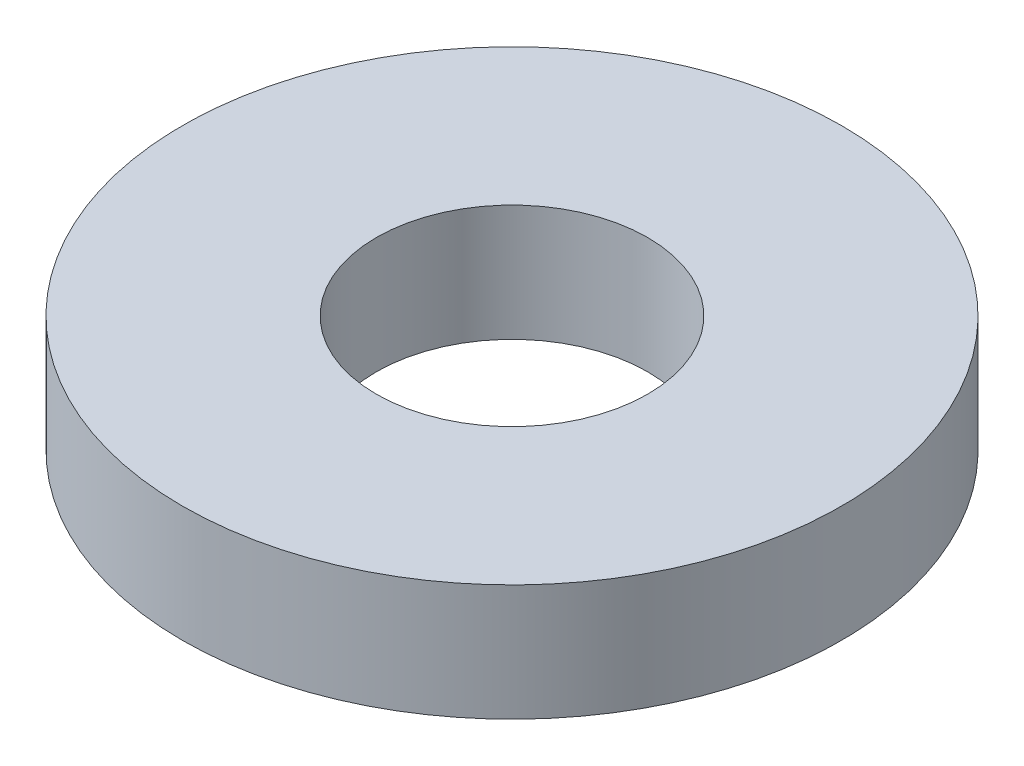
ISO-10303-21;
HEADER;
FILE_DESCRIPTION(('STEP AP214'),'2;1');
FILE_NAME('part.step','',(''),(''),'','','');
FILE_SCHEMA(('AUTOMOTIVE_DESIGN { 1 0 10303 214 1 1 1 1 }'));
ENDSEC;
DATA;
#1=APPLICATION_CONTEXT('core data for automotive mechanical design processes');
#2=APPLICATION_PROTOCOL_DEFINITION('international standard','automotive_design',2000,#1);
#3=PRODUCT_CONTEXT('',#1,'mechanical');
#4=PRODUCT('Part','Part','',(#3));
#5=PRODUCT_RELATED_PRODUCT_CATEGORY('part','',(#4));
#6=PRODUCT_DEFINITION_FORMATION('','',#4);
#7=PRODUCT_DEFINITION_CONTEXT('part definition',#1,'design');
#8=PRODUCT_DEFINITION('design','',#6,#7);
#9=PRODUCT_DEFINITION_SHAPE('','',#8);
#10=(LENGTH_UNIT() NAMED_UNIT(*) SI_UNIT(.MILLI.,.METRE.));
#11=(NAMED_UNIT(*) PLANE_ANGLE_UNIT() SI_UNIT($,.RADIAN.));
#12=(NAMED_UNIT(*) SI_UNIT($,.STERADIAN.) SOLID_ANGLE_UNIT());
#13=UNCERTAINTY_MEASURE_WITH_UNIT(LENGTH_MEASURE(1.E-05),#10,'distance_accuracy_value','');
#14=(GEOMETRIC_REPRESENTATION_CONTEXT(3) GLOBAL_UNCERTAINTY_ASSIGNED_CONTEXT((#13)) GLOBAL_UNIT_ASSIGNED_CONTEXT((#10,
#11,#12)) REPRESENTATION_CONTEXT('',''));
#15=CARTESIAN_POINT('',(0.,0.,0.));
#16=DIRECTION('',(0.,0.,1.));
#17=DIRECTION('',(1.,0.,0.));
#18=AXIS2_PLACEMENT_3D('',#15,#16,#17);
#19=CARTESIAN_POINT('',(0.,1.5,0.));
#20=DIRECTION('',(0.,1.,0.));
#21=DIRECTION('',(0.,0.,1.));
#22=AXIS2_PLACEMENT_3D('',#19,#20,#21);
#23=PLANE('',#22);
#24=CARTESIAN_POINT('',(0.,1.5,0.));
#25=DIRECTION('',(0.,1.,0.));
#26=DIRECTION('',(0.,0.,1.));
#27=AXIS2_PLACEMENT_3D('',#24,#25,#26);
#28=CIRCLE('',#27,4.25);
#29=CARTESIAN_POINT('',(0.,1.5,4.25));
#30=VERTEX_POINT('',#29);
#31=EDGE_CURVE('E10',#30,#30,#28,.T.);
#32=ORIENTED_EDGE('',*,*,#31,.T.);
#33=EDGE_LOOP('',(#32));
#34=FACE_BOUND('',#33,.T.);
#35=CARTESIAN_POINT('',(0.,1.5,0.));
#36=DIRECTION('',(0.,1.,0.));
#37=DIRECTION('',(0.,0.,1.));
#38=AXIS2_PLACEMENT_3D('',#35,#36,#37);
#39=CIRCLE('',#38,1.75);
#40=CARTESIAN_POINT('',(0.,1.5,1.75));
#41=VERTEX_POINT('',#40);
#42=EDGE_CURVE('E42',#41,#41,#39,.T.);
#43=ORIENTED_EDGE('',*,*,#42,.F.);
#44=EDGE_LOOP('',(#43));
#45=FACE_BOUND('',#44,.T.);
#46=ADVANCED_FACE('F31',(#34,#45),#23,.T.);
#47=CARTESIAN_POINT('',(0.,0.,0.));
#48=DIRECTION('',(0.,1.,0.));
#49=DIRECTION('',(0.,0.,1.));
#50=AXIS2_PLACEMENT_3D('',#47,#48,#49);
#51=PLANE('',#50);
#52=CARTESIAN_POINT('',(0.,0.,0.));
#53=DIRECTION('',(0.,1.,0.));
#54=DIRECTION('',(0.,0.,1.));
#55=AXIS2_PLACEMENT_3D('',#52,#53,#54);
#56=CIRCLE('',#55,4.25);
#57=CARTESIAN_POINT('',(0.,0.,4.25));
#58=VERTEX_POINT('',#57);
#59=EDGE_CURVE('E35',#58,#58,#56,.T.);
#60=ORIENTED_EDGE('',*,*,#59,.F.);
#61=EDGE_LOOP('',(#60));
#62=FACE_BOUND('',#61,.T.);
#63=CARTESIAN_POINT('',(0.,0.,0.));
#64=DIRECTION('',(0.,1.,0.));
#65=DIRECTION('',(0.,0.,1.));
#66=AXIS2_PLACEMENT_3D('',#63,#64,#65);
#67=CIRCLE('',#66,1.75);
#68=CARTESIAN_POINT('',(0.,0.,1.75));
#69=VERTEX_POINT('',#68);
#70=EDGE_CURVE('E44',#69,#69,#67,.T.);
#71=ORIENTED_EDGE('',*,*,#70,.T.);
#72=EDGE_LOOP('',(#71));
#73=FACE_BOUND('',#72,.T.);
#74=ADVANCED_FACE('F54',(#62,#73),#51,.F.);
#75=CARTESIAN_POINT('',(0.,1.5,0.));
#76=DIRECTION('',(0.,-1.,0.));
#77=DIRECTION('',(0.,0.,-1.));
#78=AXIS2_PLACEMENT_3D('',#75,#76,#77);
#79=CYLINDRICAL_SURFACE('',#78,4.25);
#80=ORIENTED_EDGE('',*,*,#31,.F.);
#81=EDGE_LOOP('',(#80));
#82=FACE_BOUND('',#81,.T.);
#83=ORIENTED_EDGE('',*,*,#59,.T.);
#84=EDGE_LOOP('',(#83));
#85=FACE_BOUND('',#84,.T.);
#86=ADVANCED_FACE('F33',(#82,#85),#79,.T.);
#87=CARTESIAN_POINT('',(0.,1.5,0.));
#88=DIRECTION('',(0.,-1.,0.));
#89=DIRECTION('',(0.,0.,-1.));
#90=AXIS2_PLACEMENT_3D('',#87,#88,#89);
#91=CYLINDRICAL_SURFACE('',#90,1.75);
#92=ORIENTED_EDGE('',*,*,#42,.T.);
#93=EDGE_LOOP('',(#92));
#94=FACE_BOUND('',#93,.T.);
#95=ORIENTED_EDGE('',*,*,#70,.F.);
#96=EDGE_LOOP('',(#95));
#97=FACE_BOUND('',#96,.T.);
#98=ADVANCED_FACE('F50',(#94,#97),#91,.F.);
#99=CLOSED_SHELL('',(#46,#74,#86,#98));
#100=MANIFOLD_SOLID_BREP('B2',#99);
#101=ADVANCED_BREP_SHAPE_REPRESENTATION('',(#18,#100),#14);
#102=SHAPE_DEFINITION_REPRESENTATION(#9,#101);
ENDSEC;
END-ISO-10303-21;
